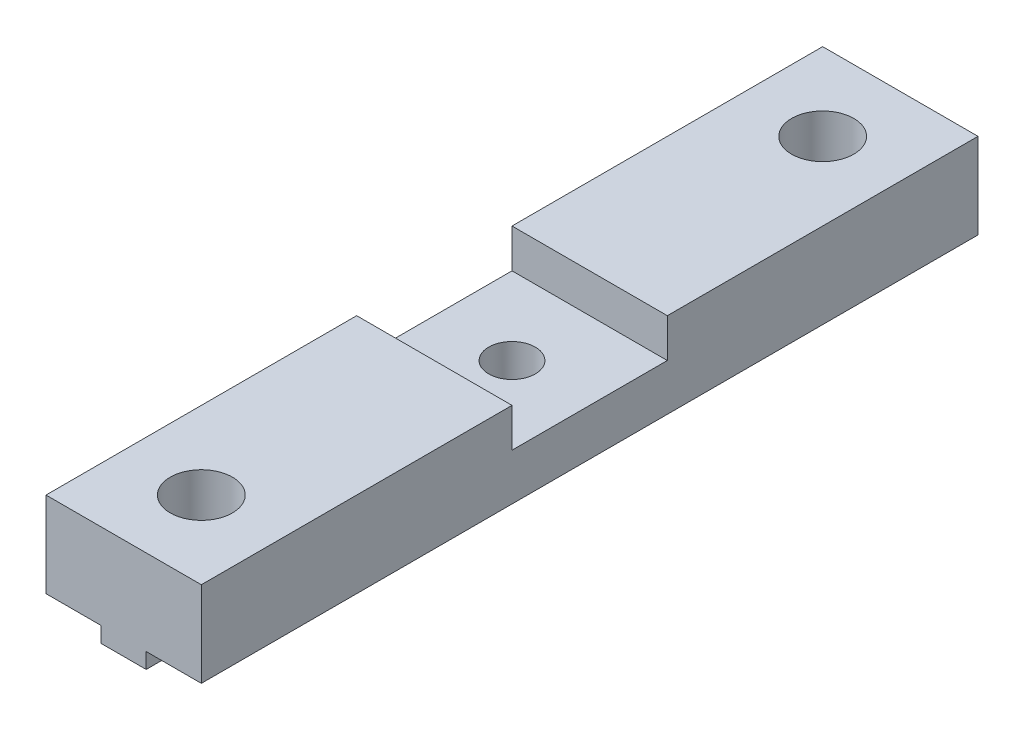
ISO-10303-21;
HEADER;
FILE_DESCRIPTION(('STEP AP214'),'2;1');
FILE_NAME('part.step','',(''),(''),'','','');
FILE_SCHEMA(('AUTOMOTIVE_DESIGN { 1 0 10303 214 1 1 1 1 }'));
ENDSEC;
DATA;
#1=APPLICATION_CONTEXT('core data for automotive mechanical design processes');
#2=APPLICATION_PROTOCOL_DEFINITION('international standard','automotive_design',2000,#1);
#3=PRODUCT_CONTEXT('',#1,'mechanical');
#4=PRODUCT('Part','Part','',(#3));
#5=PRODUCT_RELATED_PRODUCT_CATEGORY('part','',(#4));
#6=PRODUCT_DEFINITION_FORMATION('','',#4);
#7=PRODUCT_DEFINITION_CONTEXT('part definition',#1,'design');
#8=PRODUCT_DEFINITION('design','',#6,#7);
#9=PRODUCT_DEFINITION_SHAPE('','',#8);
#10=(LENGTH_UNIT() NAMED_UNIT(*) SI_UNIT(.MILLI.,.METRE.));
#11=(NAMED_UNIT(*) PLANE_ANGLE_UNIT() SI_UNIT($,.RADIAN.));
#12=(NAMED_UNIT(*) SI_UNIT($,.STERADIAN.) SOLID_ANGLE_UNIT());
#13=UNCERTAINTY_MEASURE_WITH_UNIT(LENGTH_MEASURE(1.E-05),#10,'distance_accuracy_value','');
#14=(GEOMETRIC_REPRESENTATION_CONTEXT(3) GLOBAL_UNCERTAINTY_ASSIGNED_CONTEXT((#13)) GLOBAL_UNIT_ASSIGNED_CONTEXT((#10,
#11,#12)) REPRESENTATION_CONTEXT('',''));
#15=CARTESIAN_POINT('',(0.,0.,0.));
#16=DIRECTION('',(0.,0.,1.));
#17=DIRECTION('',(1.,0.,0.));
#18=AXIS2_PLACEMENT_3D('',#15,#16,#17);
#19=CARTESIAN_POINT('',(-5.,0.,25.));
#20=DIRECTION('',(0.,-1.,0.));
#21=DIRECTION('',(0.,0.,-1.));
#22=AXIS2_PLACEMENT_3D('',#19,#20,#21);
#23=PLANE('',#22);
#24=CARTESIAN_POINT('',(0.,0.,-20.));
#25=DIRECTION('',(0.,1.,0.));
#26=DIRECTION('',(0.,0.,1.));
#27=AXIS2_PLACEMENT_3D('',#24,#25,#26);
#28=CIRCLE('',#27,2.);
#29=CARTESIAN_POINT('',(0.,0.,-18.));
#30=VERTEX_POINT('',#29);
#31=EDGE_CURVE('E276',#30,#30,#28,.T.);
#32=ORIENTED_EDGE('',*,*,#31,.F.);
#33=EDGE_LOOP('',(#32));
#34=FACE_BOUND('',#33,.T.);
#35=DIRECTION('',(0.,0.,-1.));
#36=VECTOR('',#35,1.);
#37=CARTESIAN_POINT('',(-5.,0.,25.));
#38=LINE('',#37,#36);
#39=CARTESIAN_POINT('',(-5.,0.,-5.));
#40=VERTEX_POINT('',#39);
#41=CARTESIAN_POINT('',(-5.,0.,-25.));
#42=VERTEX_POINT('',#41);
#43=EDGE_CURVE('E320',#40,#42,#38,.T.);
#44=ORIENTED_EDGE('',*,*,#43,.F.);
#45=DIRECTION('',(-1.,0.,0.));
#46=VECTOR('',#45,1.);
#47=CARTESIAN_POINT('',(5.,0.,-5.));
#48=LINE('',#47,#46);
#49=CARTESIAN_POINT('',(5.,0.,-5.));
#50=VERTEX_POINT('',#49);
#51=EDGE_CURVE('E227',#50,#40,#48,.T.);
#52=ORIENTED_EDGE('',*,*,#51,.F.);
#53=DIRECTION('',(0.,0.,-1.));
#54=VECTOR('',#53,1.);
#55=CARTESIAN_POINT('',(5.,0.,25.));
#56=LINE('',#55,#54);
#57=CARTESIAN_POINT('',(5.,0.,-25.));
#58=VERTEX_POINT('',#57);
#59=EDGE_CURVE('E219',#50,#58,#56,.T.);
#60=ORIENTED_EDGE('',*,*,#59,.T.);
#61=DIRECTION('',(-1.,0.,0.));
#62=VECTOR('',#61,1.);
#63=CARTESIAN_POINT('',(-5.,0.,-25.));
#64=LINE('',#63,#62);
#65=EDGE_CURVE('E306',#58,#42,#64,.T.);
#66=ORIENTED_EDGE('',*,*,#65,.T.);
#67=EDGE_LOOP('',(#44,#52,#60,#66));
#68=FACE_BOUND('',#67,.T.);
#69=ADVANCED_FACE('F33',(#34,#68),#23,.F.);
#70=CARTESIAN_POINT('',(1.45,-5.5,25.));
#71=DIRECTION('',(-1.,0.,0.));
#72=DIRECTION('',(0.,0.,1.));
#73=AXIS2_PLACEMENT_3D('',#70,#71,#72);
#74=PLANE('',#73);
#75=DIRECTION('',(0.,0.,-1.));
#76=VECTOR('',#75,1.);
#77=CARTESIAN_POINT('',(1.45,-6.5,25.));
#78=LINE('',#77,#76);
#79=CARTESIAN_POINT('',(1.45,-6.5,25.));
#80=VERTEX_POINT('',#79);
#81=CARTESIAN_POINT('',(1.45,-6.5,21.3774977313956));
#82=VERTEX_POINT('',#81);
#83=EDGE_CURVE('E357',#80,#82,#78,.T.);
#84=ORIENTED_EDGE('',*,*,#83,.T.);
#85=DIRECTION('',(0.,1.,0.));
#86=VECTOR('',#85,1.);
#87=CARTESIAN_POINT('',(1.45,-6.5,21.3774977313956));
#88=LINE('',#87,#86);
#89=CARTESIAN_POINT('',(1.45,-5.5,21.3774977313956));
#90=VERTEX_POINT('',#89);
#91=EDGE_CURVE('E264',#82,#90,#88,.T.);
#92=ORIENTED_EDGE('',*,*,#91,.T.);
#93=DIRECTION('',(0.,0.,-1.));
#94=VECTOR('',#93,1.);
#95=CARTESIAN_POINT('',(1.45,-5.5,25.));
#96=LINE('',#95,#94);
#97=CARTESIAN_POINT('',(1.45,-5.5,25.));
#98=VERTEX_POINT('',#97);
#99=EDGE_CURVE('E351',#98,#90,#96,.T.);
#100=ORIENTED_EDGE('',*,*,#99,.F.);
#101=DIRECTION('',(0.,1.,0.));
#102=VECTOR('',#101,1.);
#103=CARTESIAN_POINT('',(1.45,-5.5,25.));
#104=LINE('',#103,#102);
#105=EDGE_CURVE('E312',#80,#98,#104,.T.);
#106=ORIENTED_EDGE('',*,*,#105,.F.);
#107=EDGE_LOOP('',(#84,#92,#100,#106));
#108=FACE_BOUND('',#107,.T.);
#109=ADVANCED_FACE('F441',(#108),#74,.F.);
#110=CARTESIAN_POINT('',(1.45,-5.5,18.6225022686044));
#111=VERTEX_POINT('',#110);
#112=CARTESIAN_POINT('',(1.45,-5.5,0.384057287393432));
#113=VERTEX_POINT('',#112);
#114=EDGE_CURVE('E355',#111,#113,#96,.T.);
#115=ORIENTED_EDGE('',*,*,#114,.F.);
#116=DIRECTION('',(0.,1.,0.));
#117=VECTOR('',#116,1.);
#118=CARTESIAN_POINT('',(1.45,-6.5,18.6225022686044));
#119=LINE('',#118,#117);
#120=CARTESIAN_POINT('',(1.45,-6.5,18.6225022686044));
#121=VERTEX_POINT('',#120);
#122=EDGE_CURVE('E261',#111,#121,#119,.F.);
#123=ORIENTED_EDGE('',*,*,#122,.T.);
#124=CARTESIAN_POINT('',(1.45,-6.5,0.384057287393432));
#125=VERTEX_POINT('',#124);
#126=EDGE_CURVE('E361',#121,#125,#78,.T.);
#127=ORIENTED_EDGE('',*,*,#126,.T.);
#128=DIRECTION('',(0.,1.,0.));
#129=VECTOR('',#128,1.);
#130=CARTESIAN_POINT('',(1.45,-6.5,0.384057287393432));
#131=LINE('',#130,#129);
#132=EDGE_CURVE('E246',#125,#113,#131,.T.);
#133=ORIENTED_EDGE('',*,*,#132,.T.);
#134=EDGE_LOOP('',(#115,#123,#127,#133));
#135=FACE_BOUND('',#134,.T.);
#136=ADVANCED_FACE('F463',(#135),#74,.F.);
#137=CARTESIAN_POINT('',(-1.45,-6.5,25.));
#138=DIRECTION('',(1.,0.,0.));
#139=DIRECTION('',(0.,0.,-1.));
#140=AXIS2_PLACEMENT_3D('',#137,#138,#139);
#141=PLANE('',#140);
#142=DIRECTION('',(0.,0.,-1.));
#143=VECTOR('',#142,1.);
#144=CARTESIAN_POINT('',(-1.45,-6.5,25.));
#145=LINE('',#144,#143);
#146=CARTESIAN_POINT('',(-1.45,-6.5,18.6225022686044));
#147=VERTEX_POINT('',#146);
#148=CARTESIAN_POINT('',(-1.45,-6.5,0.384057287393432));
#149=VERTEX_POINT('',#148);
#150=EDGE_CURVE('E367',#147,#149,#145,.T.);
#151=ORIENTED_EDGE('',*,*,#150,.F.);
#152=DIRECTION('',(0.,1.,0.));
#153=VECTOR('',#152,1.);
#154=CARTESIAN_POINT('',(-1.45,-6.5,18.6225022686044));
#155=LINE('',#154,#153);
#156=CARTESIAN_POINT('',(-1.45,-5.5,18.6225022686044));
#157=VERTEX_POINT('',#156);
#158=EDGE_CURVE('E273',#147,#157,#155,.T.);
#159=ORIENTED_EDGE('',*,*,#158,.T.);
#160=DIRECTION('',(0.,0.,-1.));
#161=VECTOR('',#160,1.);
#162=CARTESIAN_POINT('',(-1.45,-5.5,25.));
#163=LINE('',#162,#161);
#164=CARTESIAN_POINT('',(-1.45,-5.5,0.384057287393432));
#165=VERTEX_POINT('',#164);
#166=EDGE_CURVE('E370',#157,#165,#163,.T.);
#167=ORIENTED_EDGE('',*,*,#166,.T.);
#168=DIRECTION('',(0.,1.,0.));
#169=VECTOR('',#168,1.);
#170=CARTESIAN_POINT('',(-1.45,-6.5,0.384057287393432));
#171=LINE('',#170,#169);
#172=EDGE_CURVE('E249',#165,#149,#171,.F.);
#173=ORIENTED_EDGE('',*,*,#172,.T.);
#174=EDGE_LOOP('',(#151,#159,#167,#173));
#175=FACE_BOUND('',#174,.T.);
#176=ADVANCED_FACE('F403',(#175),#141,.F.);
#177=CARTESIAN_POINT('',(-1.45,-6.5,-0.384057287393432));
#178=VERTEX_POINT('',#177);
#179=CARTESIAN_POINT('',(-1.45,-6.5,-18.6225022686044));
#180=VERTEX_POINT('',#179);
#181=EDGE_CURVE('E368',#178,#180,#145,.T.);
#182=ORIENTED_EDGE('',*,*,#181,.F.);
#183=DIRECTION('',(0.,1.,0.));
#184=VECTOR('',#183,1.);
#185=CARTESIAN_POINT('',(-1.45,-6.5,-0.384057287393432));
#186=LINE('',#185,#184);
#187=CARTESIAN_POINT('',(-1.45,-5.5,-0.384057287393432));
#188=VERTEX_POINT('',#187);
#189=EDGE_CURVE('E255',#178,#188,#186,.T.);
#190=ORIENTED_EDGE('',*,*,#189,.T.);
#191=CARTESIAN_POINT('',(-1.45,-5.5,-18.6225022686044));
#192=VERTEX_POINT('',#191);
#193=EDGE_CURVE('E371',#188,#192,#163,.T.);
#194=ORIENTED_EDGE('',*,*,#193,.T.);
#195=DIRECTION('',(0.,1.,0.));
#196=VECTOR('',#195,1.);
#197=CARTESIAN_POINT('',(-1.45,-6.5,-18.6225022686044));
#198=LINE('',#197,#196);
#199=EDGE_CURVE('E292',#192,#180,#198,.F.);
#200=ORIENTED_EDGE('',*,*,#199,.T.);
#201=EDGE_LOOP('',(#182,#190,#194,#200));
#202=FACE_BOUND('',#201,.T.);
#203=ADVANCED_FACE('F409',(#202),#141,.F.);
#204=CARTESIAN_POINT('',(1.45,-6.5,25.));
#205=DIRECTION('',(0.,1.,0.));
#206=DIRECTION('',(0.,0.,1.));
#207=AXIS2_PLACEMENT_3D('',#204,#205,#206);
#208=PLANE('',#207);
#209=ORIENTED_EDGE('',*,*,#126,.F.);
#210=CARTESIAN_POINT('',(0.,-6.5,20.));
#211=DIRECTION('',(0.,1.,0.));
#212=DIRECTION('',(0.,0.,1.));
#213=AXIS2_PLACEMENT_3D('',#210,#211,#212);
#214=CIRCLE('',#213,2.);
#215=EDGE_CURVE('E235',#121,#147,#214,.T.);
#216=ORIENTED_EDGE('',*,*,#215,.T.);
#217=ORIENTED_EDGE('',*,*,#150,.T.);
#218=CARTESIAN_POINT('',(0.,-6.5,0.));
#219=DIRECTION('',(0.,1.,0.));
#220=DIRECTION('',(0.,0.,1.));
#221=AXIS2_PLACEMENT_3D('',#218,#219,#220);
#222=CIRCLE('',#221,1.5);
#223=EDGE_CURVE('E240',#149,#125,#222,.T.);
#224=ORIENTED_EDGE('',*,*,#223,.T.);
#225=EDGE_LOOP('',(#209,#216,#217,#224));
#226=FACE_BOUND('',#225,.T.);
#227=ADVANCED_FACE('F400',(#226),#208,.F.);
#228=CARTESIAN_POINT('',(1.45,-6.5,-0.384057287393432));
#229=VERTEX_POINT('',#228);
#230=CARTESIAN_POINT('',(1.45,-6.5,-18.6225022686044));
#231=VERTEX_POINT('',#230);
#232=EDGE_CURVE('E362',#229,#231,#78,.T.);
#233=ORIENTED_EDGE('',*,*,#232,.F.);
#234=EDGE_CURVE('E239',#229,#178,#222,.T.);
#235=ORIENTED_EDGE('',*,*,#234,.T.);
#236=ORIENTED_EDGE('',*,*,#181,.T.);
#237=CARTESIAN_POINT('',(0.,-6.5,-20.));
#238=DIRECTION('',(0.,1.,0.));
#239=DIRECTION('',(0.,0.,1.));
#240=AXIS2_PLACEMENT_3D('',#237,#238,#239);
#241=CIRCLE('',#240,2.);
#242=EDGE_CURVE('E277',#180,#231,#241,.T.);
#243=ORIENTED_EDGE('',*,*,#242,.T.);
#244=EDGE_LOOP('',(#233,#235,#236,#243));
#245=FACE_BOUND('',#244,.T.);
#246=ADVANCED_FACE('F417',(#245),#208,.F.);
#247=CARTESIAN_POINT('',(-1.45,-6.5,-21.3774977313956));
#248=VERTEX_POINT('',#247);
#249=CARTESIAN_POINT('',(-1.45,-6.5,-25.));
#250=VERTEX_POINT('',#249);
#251=EDGE_CURVE('E360',#248,#250,#145,.T.);
#252=ORIENTED_EDGE('',*,*,#251,.F.);
#253=DIRECTION('',(0.,1.,0.));
#254=VECTOR('',#253,1.);
#255=CARTESIAN_POINT('',(-1.45,-6.5,-21.3774977313956));
#256=LINE('',#255,#254);
#257=CARTESIAN_POINT('',(-1.45,-5.5,-21.3774977313956));
#258=VERTEX_POINT('',#257);
#259=EDGE_CURVE('E298',#248,#258,#256,.T.);
#260=ORIENTED_EDGE('',*,*,#259,.T.);
#261=CARTESIAN_POINT('',(-1.45,-5.5,-25.));
#262=VERTEX_POINT('',#261);
#263=EDGE_CURVE('E366',#258,#262,#163,.T.);
#264=ORIENTED_EDGE('',*,*,#263,.T.);
#265=DIRECTION('',(0.,-1.,0.));
#266=VECTOR('',#265,1.);
#267=CARTESIAN_POINT('',(-1.45,-6.5,-25.));
#268=LINE('',#267,#266);
#269=EDGE_CURVE('E326',#262,#250,#268,.T.);
#270=ORIENTED_EDGE('',*,*,#269,.T.);
#271=EDGE_LOOP('',(#252,#260,#264,#270));
#272=FACE_BOUND('',#271,.T.);
#273=ADVANCED_FACE('F379',(#272),#141,.F.);
#274=CARTESIAN_POINT('',(1.45,-6.5,-21.3774977313956));
#275=VERTEX_POINT('',#274);
#276=CARTESIAN_POINT('',(1.45,-6.5,-25.));
#277=VERTEX_POINT('',#276);
#278=EDGE_CURVE('E354',#275,#277,#78,.T.);
#279=ORIENTED_EDGE('',*,*,#278,.F.);
#280=EDGE_CURVE('E280',#275,#248,#241,.T.);
#281=ORIENTED_EDGE('',*,*,#280,.T.);
#282=ORIENTED_EDGE('',*,*,#251,.T.);
#283=DIRECTION('',(1.,0.,0.));
#284=VECTOR('',#283,1.);
#285=CARTESIAN_POINT('',(1.45,-6.5,-25.));
#286=LINE('',#285,#284);
#287=EDGE_CURVE('E329',#250,#277,#286,.T.);
#288=ORIENTED_EDGE('',*,*,#287,.T.);
#289=EDGE_LOOP('',(#279,#281,#282,#288));
#290=FACE_BOUND('',#289,.T.);
#291=ADVANCED_FACE('F393',(#290),#208,.F.);
#292=CARTESIAN_POINT('',(1.45,-5.5,-0.384057287393432));
#293=VERTEX_POINT('',#292);
#294=CARTESIAN_POINT('',(1.45,-5.5,-18.6225022686044));
#295=VERTEX_POINT('',#294);
#296=EDGE_CURVE('E356',#293,#295,#96,.T.);
#297=ORIENTED_EDGE('',*,*,#296,.F.);
#298=DIRECTION('',(0.,1.,0.));
#299=VECTOR('',#298,1.);
#300=CARTESIAN_POINT('',(1.45,-6.5,-0.384057287393432));
#301=LINE('',#300,#299);
#302=EDGE_CURVE('E57',#293,#229,#301,.F.);
#303=ORIENTED_EDGE('',*,*,#302,.T.);
#304=ORIENTED_EDGE('',*,*,#232,.T.);
#305=DIRECTION('',(0.,1.,0.));
#306=VECTOR('',#305,1.);
#307=CARTESIAN_POINT('',(1.45,-6.5,-18.6225022686044));
#308=LINE('',#307,#306);
#309=EDGE_CURVE('E289',#231,#295,#308,.T.);
#310=ORIENTED_EDGE('',*,*,#309,.T.);
#311=EDGE_LOOP('',(#297,#303,#304,#310));
#312=FACE_BOUND('',#311,.T.);
#313=ADVANCED_FACE('F421',(#312),#74,.F.);
#314=CARTESIAN_POINT('',(-5.,-5.5,25.));
#315=DIRECTION('',(1.,0.,0.));
#316=DIRECTION('',(0.,0.,-1.));
#317=AXIS2_PLACEMENT_3D('',#314,#315,#316);
#318=PLANE('',#317);
#319=DIRECTION('',(0.,0.,1.));
#320=VECTOR('',#319,1.);
#321=CARTESIAN_POINT('',(-5.,-2.5,-5.));
#322=LINE('',#321,#320);
#323=CARTESIAN_POINT('',(-5.,-2.5,-5.));
#324=VERTEX_POINT('',#323);
#325=CARTESIAN_POINT('',(-5.,-2.5,5.));
#326=VERTEX_POINT('',#325);
#327=EDGE_CURVE('E221',#324,#326,#322,.T.);
#328=ORIENTED_EDGE('',*,*,#327,.F.);
#329=DIRECTION('',(0.,-1.,0.));
#330=VECTOR('',#329,1.);
#331=CARTESIAN_POINT('',(-5.,0.,-5.));
#332=LINE('',#331,#330);
#333=EDGE_CURVE('E201',#40,#324,#332,.T.);
#334=ORIENTED_EDGE('',*,*,#333,.F.);
#335=ORIENTED_EDGE('',*,*,#43,.T.);
#336=DIRECTION('',(0.,-1.,0.));
#337=VECTOR('',#336,1.);
#338=CARTESIAN_POINT('',(-5.,-5.5,-25.));
#339=LINE('',#338,#337);
#340=CARTESIAN_POINT('',(-5.,-5.5,-25.));
#341=VERTEX_POINT('',#340);
#342=EDGE_CURVE('E301',#42,#341,#339,.T.);
#343=ORIENTED_EDGE('',*,*,#342,.T.);
#344=DIRECTION('',(0.,0.,-1.));
#345=VECTOR('',#344,1.);
#346=CARTESIAN_POINT('',(-5.,-5.5,25.));
#347=LINE('',#346,#345);
#348=CARTESIAN_POINT('',(-5.,-5.5,25.));
#349=VERTEX_POINT('',#348);
#350=EDGE_CURVE('E11',#349,#341,#347,.T.);
#351=ORIENTED_EDGE('',*,*,#350,.F.);
#352=DIRECTION('',(0.,-1.,0.));
#353=VECTOR('',#352,1.);
#354=CARTESIAN_POINT('',(-5.,-5.5,25.));
#355=LINE('',#354,#353);
#356=CARTESIAN_POINT('',(-5.,0.,25.));
#357=VERTEX_POINT('',#356);
#358=EDGE_CURVE('E302',#357,#349,#355,.T.);
#359=ORIENTED_EDGE('',*,*,#358,.F.);
#360=CARTESIAN_POINT('',(-5.,0.,5.));
#361=VERTEX_POINT('',#360);
#362=EDGE_CURVE('E341',#357,#361,#38,.T.);
#363=ORIENTED_EDGE('',*,*,#362,.T.);
#364=DIRECTION('',(0.,1.,0.));
#365=VECTOR('',#364,1.);
#366=CARTESIAN_POINT('',(-5.,0.,5.));
#367=LINE('',#366,#365);
#368=EDGE_CURVE('E49',#326,#361,#367,.T.);
#369=ORIENTED_EDGE('',*,*,#368,.F.);
#370=EDGE_LOOP('',(#328,#334,#335,#343,#351,#359,#363,#369));
#371=FACE_BOUND('',#370,.T.);
#372=ADVANCED_FACE('F35',(#371),#318,.F.);
#373=CARTESIAN_POINT('',(-1.45,-5.5,25.));
#374=DIRECTION('',(0.,1.,0.));
#375=DIRECTION('',(0.,0.,1.));
#376=AXIS2_PLACEMENT_3D('',#373,#374,#375);
#377=PLANE('',#376);
#378=ORIENTED_EDGE('',*,*,#166,.F.);
#379=CARTESIAN_POINT('',(0.,-5.5,20.));
#380=DIRECTION('',(0.,1.,0.));
#381=DIRECTION('',(0.,0.,1.));
#382=AXIS2_PLACEMENT_3D('',#379,#380,#381);
#383=CIRCLE('',#382,2.);
#384=CARTESIAN_POINT('',(-1.45,-5.5,21.3774977313956));
#385=VERTEX_POINT('',#384);
#386=EDGE_CURVE('E270',#157,#385,#383,.T.);
#387=ORIENTED_EDGE('',*,*,#386,.T.);
#388=CARTESIAN_POINT('',(-1.45,-5.5,25.));
#389=VERTEX_POINT('',#388);
#390=EDGE_CURVE('E42',#389,#385,#163,.T.);
#391=ORIENTED_EDGE('',*,*,#390,.F.);
#392=DIRECTION('',(1.,0.,0.));
#393=VECTOR('',#392,1.);
#394=CARTESIAN_POINT('',(-1.45,-5.5,25.));
#395=LINE('',#394,#393);
#396=EDGE_CURVE('E305',#349,#389,#395,.T.);
#397=ORIENTED_EDGE('',*,*,#396,.F.);
#398=ORIENTED_EDGE('',*,*,#350,.T.);
#399=DIRECTION('',(1.,0.,0.));
#400=VECTOR('',#399,1.);
#401=CARTESIAN_POINT('',(-1.45,-5.5,-25.));
#402=LINE('',#401,#400);
#403=EDGE_CURVE('E323',#341,#262,#402,.T.);
#404=ORIENTED_EDGE('',*,*,#403,.T.);
#405=ORIENTED_EDGE('',*,*,#263,.F.);
#406=CARTESIAN_POINT('',(0.,-5.5,-20.));
#407=DIRECTION('',(0.,1.,0.));
#408=DIRECTION('',(0.,0.,1.));
#409=AXIS2_PLACEMENT_3D('',#406,#407,#408);
#410=CIRCLE('',#409,2.);
#411=EDGE_CURVE('E295',#258,#192,#410,.T.);
#412=ORIENTED_EDGE('',*,*,#411,.T.);
#413=ORIENTED_EDGE('',*,*,#193,.F.);
#414=CARTESIAN_POINT('',(0.,-5.5,0.));
#415=DIRECTION('',(0.,1.,0.));
#416=DIRECTION('',(0.,0.,1.));
#417=AXIS2_PLACEMENT_3D('',#414,#415,#416);
#418=CIRCLE('',#417,1.5);
#419=EDGE_CURVE('E252',#188,#165,#418,.T.);
#420=ORIENTED_EDGE('',*,*,#419,.T.);
#421=EDGE_LOOP('',(#378,#387,#391,#397,#398,#404,#405,#412,#413,#420));
#422=FACE_BOUND('',#421,.T.);
#423=ADVANCED_FACE('F384',(#422),#377,.F.);
#424=ORIENTED_EDGE('',*,*,#390,.T.);
#425=DIRECTION('',(0.,1.,0.));
#426=VECTOR('',#425,1.);
#427=CARTESIAN_POINT('',(-1.45,-6.5,21.3774977313956));
#428=LINE('',#427,#426);
#429=CARTESIAN_POINT('',(-1.45,-6.5,21.3774977313956));
#430=VERTEX_POINT('',#429);
#431=EDGE_CURVE('E267',#385,#430,#428,.F.);
#432=ORIENTED_EDGE('',*,*,#431,.T.);
#433=CARTESIAN_POINT('',(-1.45,-6.5,25.));
#434=VERTEX_POINT('',#433);
#435=EDGE_CURVE('E363',#434,#430,#145,.T.);
#436=ORIENTED_EDGE('',*,*,#435,.F.);
#437=DIRECTION('',(0.,-1.,0.));
#438=VECTOR('',#437,1.);
#439=CARTESIAN_POINT('',(-1.45,-6.5,25.));
#440=LINE('',#439,#438);
#441=EDGE_CURVE('E308',#389,#434,#440,.T.);
#442=ORIENTED_EDGE('',*,*,#441,.F.);
#443=EDGE_LOOP('',(#424,#432,#436,#442));
#444=FACE_BOUND('',#443,.T.);
#445=ADVANCED_FACE('F447',(#444),#141,.F.);
#446=ORIENTED_EDGE('',*,*,#435,.T.);
#447=EDGE_CURVE('E232',#430,#82,#214,.T.);
#448=ORIENTED_EDGE('',*,*,#447,.T.);
#449=ORIENTED_EDGE('',*,*,#83,.F.);
#450=DIRECTION('',(1.,0.,0.));
#451=VECTOR('',#450,1.);
#452=CARTESIAN_POINT('',(1.45,-6.5,25.));
#453=LINE('',#452,#451);
#454=EDGE_CURVE('E310',#434,#80,#453,.T.);
#455=ORIENTED_EDGE('',*,*,#454,.F.);
#456=EDGE_LOOP('',(#446,#448,#449,#455));
#457=FACE_BOUND('',#456,.T.);
#458=ADVANCED_FACE('F445',(#457),#208,.F.);
#459=CARTESIAN_POINT('',(1.45,-5.5,-21.3774977313956));
#460=VERTEX_POINT('',#459);
#461=CARTESIAN_POINT('',(1.45,-5.5,-25.));
#462=VERTEX_POINT('',#461);
#463=EDGE_CURVE('E350',#460,#462,#96,.T.);
#464=ORIENTED_EDGE('',*,*,#463,.F.);
#465=DIRECTION('',(0.,1.,0.));
#466=VECTOR('',#465,1.);
#467=CARTESIAN_POINT('',(1.45,-6.5,-21.3774977313956));
#468=LINE('',#467,#466);
#469=EDGE_CURVE('E286',#460,#275,#468,.F.);
#470=ORIENTED_EDGE('',*,*,#469,.T.);
#471=ORIENTED_EDGE('',*,*,#278,.T.);
#472=DIRECTION('',(0.,1.,0.));
#473=VECTOR('',#472,1.);
#474=CARTESIAN_POINT('',(1.45,-5.5,-25.));
#475=LINE('',#474,#473);
#476=EDGE_CURVE('E332',#277,#462,#475,.T.);
#477=ORIENTED_EDGE('',*,*,#476,.T.);
#478=EDGE_LOOP('',(#464,#470,#471,#477));
#479=FACE_BOUND('',#478,.T.);
#480=ADVANCED_FACE('F428',(#479),#74,.F.);
#481=CARTESIAN_POINT('',(5.,-5.5,25.));
#482=DIRECTION('',(0.,1.,0.));
#483=DIRECTION('',(0.,0.,1.));
#484=AXIS2_PLACEMENT_3D('',#481,#482,#483);
#485=PLANE('',#484);
#486=ORIENTED_EDGE('',*,*,#99,.T.);
#487=CARTESIAN_POINT('',(0.,-5.5,20.));
#488=DIRECTION('',(0.,1.,0.));
#489=DIRECTION('',(0.,0.,1.));
#490=AXIS2_PLACEMENT_3D('',#487,#488,#489);
#491=CIRCLE('',#490,2.);
#492=EDGE_CURVE('E258',#90,#111,#491,.T.);
#493=ORIENTED_EDGE('',*,*,#492,.T.);
#494=ORIENTED_EDGE('',*,*,#114,.T.);
#495=CARTESIAN_POINT('',(0.,-5.5,0.));
#496=DIRECTION('',(0.,1.,0.));
#497=DIRECTION('',(0.,0.,1.));
#498=AXIS2_PLACEMENT_3D('',#495,#496,#497);
#499=CIRCLE('',#498,1.5);
#500=EDGE_CURVE('E243',#113,#293,#499,.T.);
#501=ORIENTED_EDGE('',*,*,#500,.T.);
#502=ORIENTED_EDGE('',*,*,#296,.T.);
#503=CARTESIAN_POINT('',(0.,-5.5,-20.));
#504=DIRECTION('',(0.,1.,0.));
#505=DIRECTION('',(0.,0.,1.));
#506=AXIS2_PLACEMENT_3D('',#503,#504,#505);
#507=CIRCLE('',#506,2.);
#508=EDGE_CURVE('E283',#295,#460,#507,.T.);
#509=ORIENTED_EDGE('',*,*,#508,.T.);
#510=ORIENTED_EDGE('',*,*,#463,.T.);
#511=DIRECTION('',(1.,0.,0.));
#512=VECTOR('',#511,1.);
#513=CARTESIAN_POINT('',(5.,-5.5,-25.));
#514=LINE('',#513,#512);
#515=CARTESIAN_POINT('',(5.,-5.5,-25.));
#516=VERTEX_POINT('',#515);
#517=EDGE_CURVE('E335',#462,#516,#514,.T.);
#518=ORIENTED_EDGE('',*,*,#517,.T.);
#519=DIRECTION('',(0.,0.,-1.));
#520=VECTOR('',#519,1.);
#521=CARTESIAN_POINT('',(5.,-5.5,25.));
#522=LINE('',#521,#520);
#523=CARTESIAN_POINT('',(5.,-5.5,25.));
#524=VERTEX_POINT('',#523);
#525=EDGE_CURVE('E347',#524,#516,#522,.T.);
#526=ORIENTED_EDGE('',*,*,#525,.F.);
#527=DIRECTION('',(1.,0.,0.));
#528=VECTOR('',#527,1.);
#529=CARTESIAN_POINT('',(5.,-5.5,25.));
#530=LINE('',#529,#528);
#531=EDGE_CURVE('E314',#98,#524,#530,.T.);
#532=ORIENTED_EDGE('',*,*,#531,.F.);
#533=EDGE_LOOP('',(#486,#493,#494,#501,#502,#509,#510,#518,#526,#532));
#534=FACE_BOUND('',#533,.T.);
#535=ADVANCED_FACE('F425',(#534),#485,.F.);
#536=CARTESIAN_POINT('',(5.,0.,25.));
#537=DIRECTION('',(-1.,0.,0.));
#538=DIRECTION('',(0.,0.,1.));
#539=AXIS2_PLACEMENT_3D('',#536,#537,#538);
#540=PLANE('',#539);
#541=ORIENTED_EDGE('',*,*,#59,.F.);
#542=DIRECTION('',(0.,-1.,0.));
#543=VECTOR('',#542,1.);
#544=CARTESIAN_POINT('',(5.,0.,-5.));
#545=LINE('',#544,#543);
#546=CARTESIAN_POINT('',(5.,-2.5,-5.));
#547=VERTEX_POINT('',#546);
#548=EDGE_CURVE('E198',#50,#547,#545,.T.);
#549=ORIENTED_EDGE('',*,*,#548,.T.);
#550=DIRECTION('',(0.,0.,1.));
#551=VECTOR('',#550,1.);
#552=CARTESIAN_POINT('',(5.,-2.5,-5.));
#553=LINE('',#552,#551);
#554=CARTESIAN_POINT('',(5.,-2.5,5.));
#555=VERTEX_POINT('',#554);
#556=EDGE_CURVE('E209',#547,#555,#553,.T.);
#557=ORIENTED_EDGE('',*,*,#556,.T.);
#558=DIRECTION('',(0.,1.,0.));
#559=VECTOR('',#558,1.);
#560=CARTESIAN_POINT('',(5.,0.,5.));
#561=LINE('',#560,#559);
#562=CARTESIAN_POINT('',(5.,0.,5.));
#563=VERTEX_POINT('',#562);
#564=EDGE_CURVE('E206',#555,#563,#561,.T.);
#565=ORIENTED_EDGE('',*,*,#564,.T.);
#566=CARTESIAN_POINT('',(5.,0.,25.));
#567=VERTEX_POINT('',#566);
#568=EDGE_CURVE('E344',#567,#563,#56,.T.);
#569=ORIENTED_EDGE('',*,*,#568,.F.);
#570=DIRECTION('',(0.,1.,0.));
#571=VECTOR('',#570,1.);
#572=CARTESIAN_POINT('',(5.,0.,25.));
#573=LINE('',#572,#571);
#574=EDGE_CURVE('E316',#524,#567,#573,.T.);
#575=ORIENTED_EDGE('',*,*,#574,.F.);
#576=ORIENTED_EDGE('',*,*,#525,.T.);
#577=DIRECTION('',(0.,1.,0.));
#578=VECTOR('',#577,1.);
#579=CARTESIAN_POINT('',(5.,0.,-25.));
#580=LINE('',#579,#578);
#581=EDGE_CURVE('E337',#516,#58,#580,.T.);
#582=ORIENTED_EDGE('',*,*,#581,.T.);
#583=EDGE_LOOP('',(#541,#549,#557,#565,#569,#575,#576,#582));
#584=FACE_BOUND('',#583,.T.);
#585=ADVANCED_FACE('F217',(#584),#540,.F.);
#586=CARTESIAN_POINT('',(0.,0.,20.));
#587=DIRECTION('',(0.,1.,0.));
#588=DIRECTION('',(0.,0.,1.));
#589=AXIS2_PLACEMENT_3D('',#586,#587,#588);
#590=CIRCLE('',#589,2.);
#591=CARTESIAN_POINT('',(0.,0.,22.));
#592=VERTEX_POINT('',#591);
#593=EDGE_CURVE('E236',#592,#592,#590,.T.);
#594=ORIENTED_EDGE('',*,*,#593,.F.);
#595=EDGE_LOOP('',(#594));
#596=FACE_BOUND('',#595,.T.);
#597=ORIENTED_EDGE('',*,*,#568,.T.);
#598=DIRECTION('',(-1.,0.,0.));
#599=VECTOR('',#598,1.);
#600=CARTESIAN_POINT('',(5.,0.,5.));
#601=LINE('',#600,#599);
#602=EDGE_CURVE('E229',#563,#361,#601,.T.);
#603=ORIENTED_EDGE('',*,*,#602,.T.);
#604=ORIENTED_EDGE('',*,*,#362,.F.);
#605=DIRECTION('',(-1.,0.,0.));
#606=VECTOR('',#605,1.);
#607=CARTESIAN_POINT('',(-5.,0.,25.));
#608=LINE('',#607,#606);
#609=EDGE_CURVE('E318',#567,#357,#608,.T.);
#610=ORIENTED_EDGE('',*,*,#609,.F.);
#611=EDGE_LOOP('',(#597,#603,#604,#610));
#612=FACE_BOUND('',#611,.T.);
#613=ADVANCED_FACE('F457',(#596,#612),#23,.F.);
#614=CARTESIAN_POINT('',(0.,0.,25.));
#615=DIRECTION('',(0.,0.,-1.));
#616=DIRECTION('',(-1.,0.,0.));
#617=AXIS2_PLACEMENT_3D('',#614,#615,#616);
#618=PLANE('',#617);
#619=ORIENTED_EDGE('',*,*,#358,.T.);
#620=ORIENTED_EDGE('',*,*,#396,.T.);
#621=ORIENTED_EDGE('',*,*,#441,.T.);
#622=ORIENTED_EDGE('',*,*,#454,.T.);
#623=ORIENTED_EDGE('',*,*,#105,.T.);
#624=ORIENTED_EDGE('',*,*,#531,.T.);
#625=ORIENTED_EDGE('',*,*,#574,.T.);
#626=ORIENTED_EDGE('',*,*,#609,.T.);
#627=EDGE_LOOP('',(#619,#620,#621,#622,#623,#624,#625,#626));
#628=FACE_BOUND('',#627,.T.);
#629=ADVANCED_FACE('F436',(#628),#618,.F.);
#630=CARTESIAN_POINT('',(0.,0.,-25.));
#631=DIRECTION('',(0.,0.,-1.));
#632=DIRECTION('',(-1.,0.,0.));
#633=AXIS2_PLACEMENT_3D('',#630,#631,#632);
#634=PLANE('',#633);
#635=ORIENTED_EDGE('',*,*,#342,.F.);
#636=ORIENTED_EDGE('',*,*,#65,.F.);
#637=ORIENTED_EDGE('',*,*,#581,.F.);
#638=ORIENTED_EDGE('',*,*,#517,.F.);
#639=ORIENTED_EDGE('',*,*,#476,.F.);
#640=ORIENTED_EDGE('',*,*,#287,.F.);
#641=ORIENTED_EDGE('',*,*,#269,.F.);
#642=ORIENTED_EDGE('',*,*,#403,.F.);
#643=EDGE_LOOP('',(#635,#636,#637,#638,#639,#640,#641,#642));
#644=FACE_BOUND('',#643,.T.);
#645=ADVANCED_FACE('F388',(#644),#634,.T.);
#646=CARTESIAN_POINT('',(0.,-6.5,-20.));
#647=DIRECTION('',(0.,1.,0.));
#648=DIRECTION('',(0.,0.,1.));
#649=AXIS2_PLACEMENT_3D('',#646,#647,#648);
#650=CYLINDRICAL_SURFACE('',#649,2.);
#651=ORIENTED_EDGE('',*,*,#31,.T.);
#652=EDGE_LOOP('',(#651));
#653=FACE_BOUND('',#652,.T.);
#654=ORIENTED_EDGE('',*,*,#280,.F.);
#655=ORIENTED_EDGE('',*,*,#469,.F.);
#656=ORIENTED_EDGE('',*,*,#508,.F.);
#657=ORIENTED_EDGE('',*,*,#309,.F.);
#658=ORIENTED_EDGE('',*,*,#242,.F.);
#659=ORIENTED_EDGE('',*,*,#199,.F.);
#660=ORIENTED_EDGE('',*,*,#411,.F.);
#661=ORIENTED_EDGE('',*,*,#259,.F.);
#662=EDGE_LOOP('',(#654,#655,#656,#657,#658,#659,#660,#661));
#663=FACE_BOUND('',#662,.T.);
#664=ADVANCED_FACE('F412',(#653,#663),#650,.F.);
#665=CARTESIAN_POINT('',(0.,-6.5,0.));
#666=DIRECTION('',(0.,1.,0.));
#667=DIRECTION('',(0.,0.,1.));
#668=AXIS2_PLACEMENT_3D('',#665,#666,#667);
#669=CYLINDRICAL_SURFACE('',#668,1.5);
#670=CARTESIAN_POINT('',(0.,-2.5,0.));
#671=DIRECTION('',(0.,-1.,0.));
#672=DIRECTION('',(0.,0.,-1.));
#673=AXIS2_PLACEMENT_3D('',#670,#671,#672);
#674=CIRCLE('',#673,1.5);
#675=CARTESIAN_POINT('',(0.,-2.5,-1.5));
#676=VERTEX_POINT('',#675);
#677=EDGE_CURVE('E37',#676,#676,#674,.F.);
#678=ORIENTED_EDGE('',*,*,#677,.T.);
#679=EDGE_LOOP('',(#678));
#680=FACE_BOUND('',#679,.T.);
#681=ORIENTED_EDGE('',*,*,#234,.F.);
#682=ORIENTED_EDGE('',*,*,#302,.F.);
#683=ORIENTED_EDGE('',*,*,#500,.F.);
#684=ORIENTED_EDGE('',*,*,#132,.F.);
#685=ORIENTED_EDGE('',*,*,#223,.F.);
#686=ORIENTED_EDGE('',*,*,#172,.F.);
#687=ORIENTED_EDGE('',*,*,#419,.F.);
#688=ORIENTED_EDGE('',*,*,#189,.F.);
#689=EDGE_LOOP('',(#681,#682,#683,#684,#685,#686,#687,#688));
#690=FACE_BOUND('',#689,.T.);
#691=ADVANCED_FACE('F404',(#680,#690),#669,.F.);
#692=CARTESIAN_POINT('',(0.,-6.5,20.));
#693=DIRECTION('',(0.,1.,0.));
#694=DIRECTION('',(0.,0.,1.));
#695=AXIS2_PLACEMENT_3D('',#692,#693,#694);
#696=CYLINDRICAL_SURFACE('',#695,2.);
#697=ORIENTED_EDGE('',*,*,#593,.T.);
#698=EDGE_LOOP('',(#697));
#699=FACE_BOUND('',#698,.T.);
#700=ORIENTED_EDGE('',*,*,#215,.F.);
#701=ORIENTED_EDGE('',*,*,#122,.F.);
#702=ORIENTED_EDGE('',*,*,#492,.F.);
#703=ORIENTED_EDGE('',*,*,#91,.F.);
#704=ORIENTED_EDGE('',*,*,#447,.F.);
#705=ORIENTED_EDGE('',*,*,#431,.F.);
#706=ORIENTED_EDGE('',*,*,#386,.F.);
#707=ORIENTED_EDGE('',*,*,#158,.F.);
#708=EDGE_LOOP('',(#700,#701,#702,#703,#704,#705,#706,#707));
#709=FACE_BOUND('',#708,.T.);
#710=ADVANCED_FACE('F443',(#699,#709),#696,.F.);
#711=CARTESIAN_POINT('',(5.,-2.5,-5.));
#712=DIRECTION('',(0.,-1.,0.));
#713=DIRECTION('',(0.,0.,-1.));
#714=AXIS2_PLACEMENT_3D('',#711,#712,#713);
#715=PLANE('',#714);
#716=ORIENTED_EDGE('',*,*,#327,.T.);
#717=DIRECTION('',(-1.,0.,0.));
#718=VECTOR('',#717,1.);
#719=CARTESIAN_POINT('',(5.,-2.5,5.));
#720=LINE('',#719,#718);
#721=EDGE_CURVE('E205',#555,#326,#720,.T.);
#722=ORIENTED_EDGE('',*,*,#721,.F.);
#723=ORIENTED_EDGE('',*,*,#556,.F.);
#724=DIRECTION('',(-1.,0.,0.));
#725=VECTOR('',#724,1.);
#726=CARTESIAN_POINT('',(5.,-2.5,-5.));
#727=LINE('',#726,#725);
#728=EDGE_CURVE('E194',#547,#324,#727,.T.);
#729=ORIENTED_EDGE('',*,*,#728,.T.);
#730=EDGE_LOOP('',(#716,#722,#723,#729));
#731=FACE_BOUND('',#730,.T.);
#732=ORIENTED_EDGE('',*,*,#677,.F.);
#733=EDGE_LOOP('',(#732));
#734=FACE_BOUND('',#733,.T.);
#735=ADVANCED_FACE('F210',(#731,#734),#715,.F.);
#736=CARTESIAN_POINT('',(5.,0.,-5.));
#737=DIRECTION('',(0.,0.,-1.));
#738=DIRECTION('',(-1.,0.,0.));
#739=AXIS2_PLACEMENT_3D('',#736,#737,#738);
#740=PLANE('',#739);
#741=ORIENTED_EDGE('',*,*,#333,.T.);
#742=ORIENTED_EDGE('',*,*,#728,.F.);
#743=ORIENTED_EDGE('',*,*,#548,.F.);
#744=ORIENTED_EDGE('',*,*,#51,.T.);
#745=EDGE_LOOP('',(#741,#742,#743,#744));
#746=FACE_BOUND('',#745,.T.);
#747=ADVANCED_FACE('F196',(#746),#740,.F.);
#748=CARTESIAN_POINT('',(5.,0.,5.));
#749=DIRECTION('',(0.,0.,1.));
#750=DIRECTION('',(1.,0.,0.));
#751=AXIS2_PLACEMENT_3D('',#748,#749,#750);
#752=PLANE('',#751);
#753=ORIENTED_EDGE('',*,*,#368,.T.);
#754=ORIENTED_EDGE('',*,*,#602,.F.);
#755=ORIENTED_EDGE('',*,*,#564,.F.);
#756=ORIENTED_EDGE('',*,*,#721,.T.);
#757=EDGE_LOOP('',(#753,#754,#755,#756));
#758=FACE_BOUND('',#757,.T.);
#759=ADVANCED_FACE('F478',(#758),#752,.F.);
#760=CLOSED_SHELL('',(#69,#109,#136,#176,#203,#227,#246,#273,#291,#313,#372,#423,#445,#458,#480,
#535,#585,#613,#629,#645,#664,#691,#710,#735,#747,#759));
#761=MANIFOLD_SOLID_BREP('B2',#760);
#762=ADVANCED_BREP_SHAPE_REPRESENTATION('',(#18,#761),#14);
#763=SHAPE_DEFINITION_REPRESENTATION(#9,#762);
ENDSEC;
END-ISO-10303-21;
